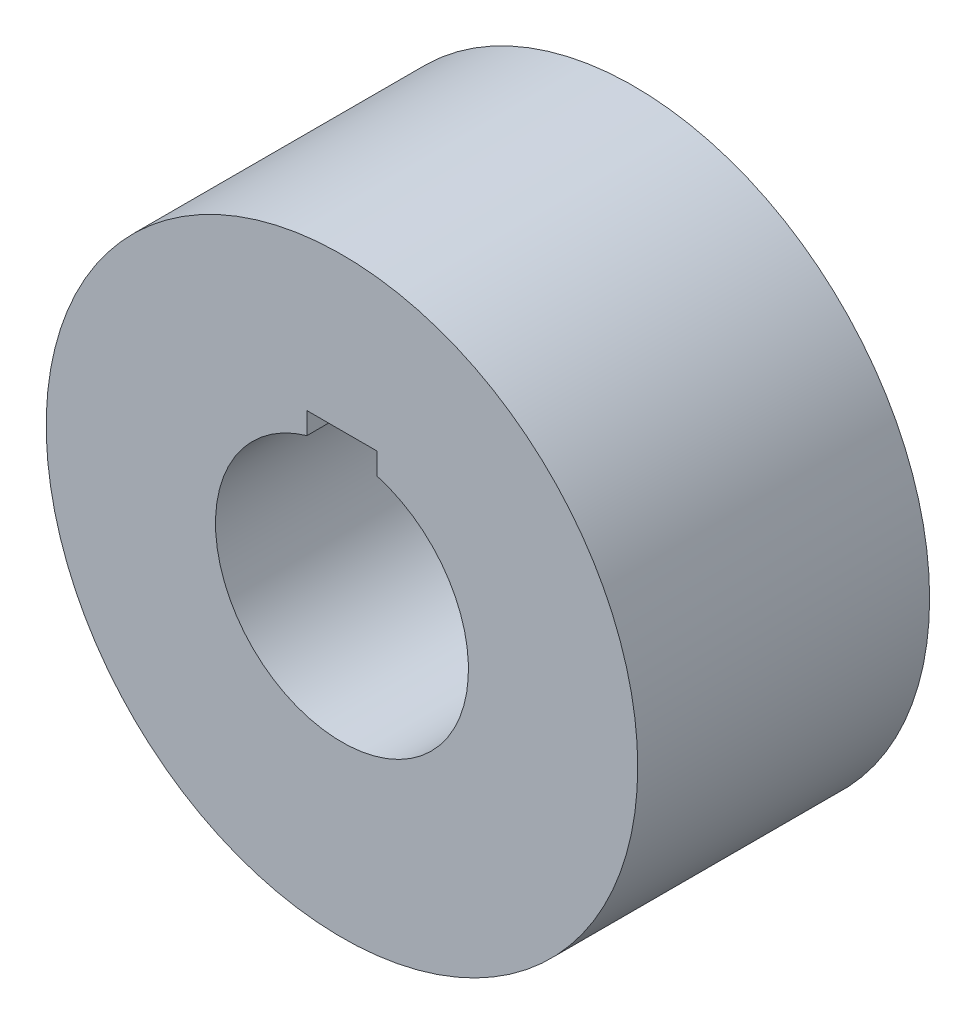
ISO-10303-21;
HEADER;
FILE_DESCRIPTION(('STEP AP214'),'2;1');
FILE_NAME('part.step','',(''),(''),'','','');
FILE_SCHEMA(('AUTOMOTIVE_DESIGN { 1 0 10303 214 1 1 1 1 }'));
ENDSEC;
DATA;
#1=APPLICATION_CONTEXT('core data for automotive mechanical design processes');
#2=APPLICATION_PROTOCOL_DEFINITION('international standard','automotive_design',2000,#1);
#3=PRODUCT_CONTEXT('',#1,'mechanical');
#4=PRODUCT('Part','Part','',(#3));
#5=PRODUCT_RELATED_PRODUCT_CATEGORY('part','',(#4));
#6=PRODUCT_DEFINITION_FORMATION('','',#4);
#7=PRODUCT_DEFINITION_CONTEXT('part definition',#1,'design');
#8=PRODUCT_DEFINITION('design','',#6,#7);
#9=PRODUCT_DEFINITION_SHAPE('','',#8);
#10=(LENGTH_UNIT() NAMED_UNIT(*) SI_UNIT(.MILLI.,.METRE.));
#11=(NAMED_UNIT(*) PLANE_ANGLE_UNIT() SI_UNIT($,.RADIAN.));
#12=(NAMED_UNIT(*) SI_UNIT($,.STERADIAN.) SOLID_ANGLE_UNIT());
#13=UNCERTAINTY_MEASURE_WITH_UNIT(LENGTH_MEASURE(1.E-05),#10,'distance_accuracy_value','');
#14=(GEOMETRIC_REPRESENTATION_CONTEXT(3) GLOBAL_UNCERTAINTY_ASSIGNED_CONTEXT((#13)) GLOBAL_UNIT_ASSIGNED_CONTEXT((#10,
#11,#12)) REPRESENTATION_CONTEXT('',''));
#15=CARTESIAN_POINT('',(0.,0.,0.));
#16=DIRECTION('',(0.,0.,1.));
#17=DIRECTION('',(1.,0.,0.));
#18=AXIS2_PLACEMENT_3D('',#15,#16,#17);
#19=CARTESIAN_POINT('',(0.,0.,75.));
#20=DIRECTION('',(0.,0.,1.));
#21=DIRECTION('',(1.,0.,0.));
#22=AXIS2_PLACEMENT_3D('',#19,#20,#21);
#23=PLANE('',#22);
#24=CARTESIAN_POINT('',(0.,0.,75.));
#25=DIRECTION('',(0.,0.,1.));
#26=DIRECTION('',(1.,0.,0.));
#27=AXIS2_PLACEMENT_3D('',#24,#25,#26);
#28=CIRCLE('',#27,76.);
#29=CARTESIAN_POINT('',(76.,0.,75.));
#30=VERTEX_POINT('',#29);
#31=EDGE_CURVE('E11',#30,#30,#28,.T.);
#32=ORIENTED_EDGE('',*,*,#31,.T.);
#33=EDGE_LOOP('',(#32));
#34=FACE_BOUND('',#33,.T.);
#35=DIRECTION('',(0.,1.,0.));
#36=VECTOR('',#35,1.);
#37=CARTESIAN_POINT('',(9.,31.2289929392544,75.));
#38=LINE('',#37,#36);
#39=CARTESIAN_POINT('',(9.,31.2289929392544,75.));
#40=VERTEX_POINT('',#39);
#41=CARTESIAN_POINT('',(9.,36.8,75.));
#42=VERTEX_POINT('',#41);
#43=EDGE_CURVE('E83',#40,#42,#38,.T.);
#44=ORIENTED_EDGE('',*,*,#43,.F.);
#45=CARTESIAN_POINT('',(0.,0.,75.));
#46=DIRECTION('',(0.,0.,1.));
#47=DIRECTION('',(1.,0.,0.));
#48=AXIS2_PLACEMENT_3D('',#45,#46,#47);
#49=CIRCLE('',#48,32.5);
#50=CARTESIAN_POINT('',(-9.,31.2289929392544,75.));
#51=VERTEX_POINT('',#50);
#52=EDGE_CURVE('E75',#51,#40,#49,.T.);
#53=ORIENTED_EDGE('',*,*,#52,.F.);
#54=DIRECTION('',(0.,-1.,0.));
#55=VECTOR('',#54,1.);
#56=CARTESIAN_POINT('',(-9.,31.2289929392544,75.));
#57=LINE('',#56,#55);
#58=CARTESIAN_POINT('',(-9.,36.8,75.));
#59=VERTEX_POINT('',#58);
#60=EDGE_CURVE('E96',#59,#51,#57,.T.);
#61=ORIENTED_EDGE('',*,*,#60,.F.);
#62=DIRECTION('',(-1.,0.,0.));
#63=VECTOR('',#62,1.);
#64=CARTESIAN_POINT('',(-9.,36.8,75.));
#65=LINE('',#64,#63);
#66=EDGE_CURVE('E94',#42,#59,#65,.T.);
#67=ORIENTED_EDGE('',*,*,#66,.F.);
#68=EDGE_LOOP('',(#44,#53,#61,#67));
#69=FACE_BOUND('',#68,.T.);
#70=ADVANCED_FACE('F34',(#34,#69),#23,.T.);
#71=CARTESIAN_POINT('',(0.,0.,0.));
#72=DIRECTION('',(0.,0.,1.));
#73=DIRECTION('',(1.,0.,0.));
#74=AXIS2_PLACEMENT_3D('',#71,#72,#73);
#75=PLANE('',#74);
#76=CARTESIAN_POINT('',(0.,0.,0.));
#77=DIRECTION('',(0.,0.,1.));
#78=DIRECTION('',(1.,0.,0.));
#79=AXIS2_PLACEMENT_3D('',#76,#77,#78);
#80=CIRCLE('',#79,76.);
#81=CARTESIAN_POINT('',(76.,0.,0.));
#82=VERTEX_POINT('',#81);
#83=EDGE_CURVE('E38',#82,#82,#80,.T.);
#84=ORIENTED_EDGE('',*,*,#83,.F.);
#85=EDGE_LOOP('',(#84));
#86=FACE_BOUND('',#85,.T.);
#87=CARTESIAN_POINT('',(0.,0.,0.));
#88=DIRECTION('',(0.,0.,1.));
#89=DIRECTION('',(1.,0.,0.));
#90=AXIS2_PLACEMENT_3D('',#87,#88,#89);
#91=CIRCLE('',#90,32.5);
#92=CARTESIAN_POINT('',(-9.,31.2289929392544,0.));
#93=VERTEX_POINT('',#92);
#94=CARTESIAN_POINT('',(9.,31.2289929392544,0.));
#95=VERTEX_POINT('',#94);
#96=EDGE_CURVE('E57',#93,#95,#91,.T.);
#97=ORIENTED_EDGE('',*,*,#96,.T.);
#98=DIRECTION('',(0.,1.,0.));
#99=VECTOR('',#98,1.);
#100=CARTESIAN_POINT('',(9.,31.2289929392544,0.));
#101=LINE('',#100,#99);
#102=CARTESIAN_POINT('',(9.,36.8,0.));
#103=VERTEX_POINT('',#102);
#104=EDGE_CURVE('E90',#95,#103,#101,.T.);
#105=ORIENTED_EDGE('',*,*,#104,.T.);
#106=DIRECTION('',(-1.,0.,0.));
#107=VECTOR('',#106,1.);
#108=CARTESIAN_POINT('',(-9.,36.8,0.));
#109=LINE('',#108,#107);
#110=CARTESIAN_POINT('',(-9.,36.8,0.));
#111=VERTEX_POINT('',#110);
#112=EDGE_CURVE('E102',#103,#111,#109,.T.);
#113=ORIENTED_EDGE('',*,*,#112,.T.);
#114=DIRECTION('',(0.,-1.,0.));
#115=VECTOR('',#114,1.);
#116=CARTESIAN_POINT('',(-9.,31.2289929392544,0.));
#117=LINE('',#116,#115);
#118=EDGE_CURVE('E84',#111,#93,#117,.T.);
#119=ORIENTED_EDGE('',*,*,#118,.T.);
#120=EDGE_LOOP('',(#97,#105,#113,#119));
#121=FACE_BOUND('',#120,.T.);
#122=ADVANCED_FACE('F113',(#86,#121),#75,.F.);
#123=CARTESIAN_POINT('',(0.,0.,75.));
#124=DIRECTION('',(0.,0.,-1.));
#125=DIRECTION('',(-1.,0.,0.));
#126=AXIS2_PLACEMENT_3D('',#123,#124,#125);
#127=CYLINDRICAL_SURFACE('',#126,76.);
#128=ORIENTED_EDGE('',*,*,#31,.F.);
#129=EDGE_LOOP('',(#128));
#130=FACE_BOUND('',#129,.T.);
#131=ORIENTED_EDGE('',*,*,#83,.T.);
#132=EDGE_LOOP('',(#131));
#133=FACE_BOUND('',#132,.T.);
#134=ADVANCED_FACE('F36',(#130,#133),#127,.T.);
#135=CARTESIAN_POINT('',(0.,0.,75.));
#136=DIRECTION('',(0.,0.,-1.));
#137=DIRECTION('',(-1.,0.,0.));
#138=AXIS2_PLACEMENT_3D('',#135,#136,#137);
#139=CYLINDRICAL_SURFACE('',#138,32.5);
#140=ORIENTED_EDGE('',*,*,#96,.F.);
#141=DIRECTION('',(0.,0.,-1.));
#142=VECTOR('',#141,1.);
#143=CARTESIAN_POINT('',(-9.,31.2289929392544,75.));
#144=LINE('',#143,#142);
#145=EDGE_CURVE('E79',#51,#93,#144,.T.);
#146=ORIENTED_EDGE('',*,*,#145,.F.);
#147=ORIENTED_EDGE('',*,*,#52,.T.);
#148=DIRECTION('',(0.,0.,-1.));
#149=VECTOR('',#148,1.);
#150=CARTESIAN_POINT('',(9.,31.2289929392544,75.));
#151=LINE('',#150,#149);
#152=EDGE_CURVE('E78',#40,#95,#151,.T.);
#153=ORIENTED_EDGE('',*,*,#152,.T.);
#154=EDGE_LOOP('',(#140,#146,#147,#153));
#155=FACE_BOUND('',#154,.T.);
#156=ADVANCED_FACE('F77',(#155),#139,.F.);
#157=CARTESIAN_POINT('',(9.,31.2289929392544,75.));
#158=DIRECTION('',(-1.,0.,0.));
#159=DIRECTION('',(0.,0.,1.));
#160=AXIS2_PLACEMENT_3D('',#157,#158,#159);
#161=PLANE('',#160);
#162=ORIENTED_EDGE('',*,*,#104,.F.);
#163=ORIENTED_EDGE('',*,*,#152,.F.);
#164=ORIENTED_EDGE('',*,*,#43,.T.);
#165=DIRECTION('',(0.,0.,-1.));
#166=VECTOR('',#165,1.);
#167=CARTESIAN_POINT('',(9.,36.8,75.));
#168=LINE('',#167,#166);
#169=EDGE_CURVE('E91',#42,#103,#168,.T.);
#170=ORIENTED_EDGE('',*,*,#169,.T.);
#171=EDGE_LOOP('',(#162,#163,#164,#170));
#172=FACE_BOUND('',#171,.T.);
#173=ADVANCED_FACE('F87',(#172),#161,.T.);
#174=CARTESIAN_POINT('',(-9.,36.8,75.));
#175=DIRECTION('',(0.,-1.,0.));
#176=DIRECTION('',(0.,0.,-1.));
#177=AXIS2_PLACEMENT_3D('',#174,#175,#176);
#178=PLANE('',#177);
#179=ORIENTED_EDGE('',*,*,#112,.F.);
#180=ORIENTED_EDGE('',*,*,#169,.F.);
#181=ORIENTED_EDGE('',*,*,#66,.T.);
#182=DIRECTION('',(0.,0.,-1.));
#183=VECTOR('',#182,1.);
#184=CARTESIAN_POINT('',(-9.,36.8,75.));
#185=LINE('',#184,#183);
#186=EDGE_CURVE('E49',#59,#111,#185,.T.);
#187=ORIENTED_EDGE('',*,*,#186,.T.);
#188=EDGE_LOOP('',(#179,#180,#181,#187));
#189=FACE_BOUND('',#188,.T.);
#190=ADVANCED_FACE('F111',(#189),#178,.T.);
#191=CARTESIAN_POINT('',(-9.,31.2289929392544,75.));
#192=DIRECTION('',(1.,0.,0.));
#193=DIRECTION('',(0.,0.,-1.));
#194=AXIS2_PLACEMENT_3D('',#191,#192,#193);
#195=PLANE('',#194);
#196=ORIENTED_EDGE('',*,*,#118,.F.);
#197=ORIENTED_EDGE('',*,*,#186,.F.);
#198=ORIENTED_EDGE('',*,*,#60,.T.);
#199=ORIENTED_EDGE('',*,*,#145,.T.);
#200=EDGE_LOOP('',(#196,#197,#198,#199));
#201=FACE_BOUND('',#200,.T.);
#202=ADVANCED_FACE('F114',(#201),#195,.T.);
#203=CLOSED_SHELL('',(#70,#122,#134,#156,#173,#190,#202));
#204=MANIFOLD_SOLID_BREP('B2',#203);
#205=ADVANCED_BREP_SHAPE_REPRESENTATION('',(#18,#204),#14);
#206=SHAPE_DEFINITION_REPRESENTATION(#9,#205);
ENDSEC;
END-ISO-10303-21;
